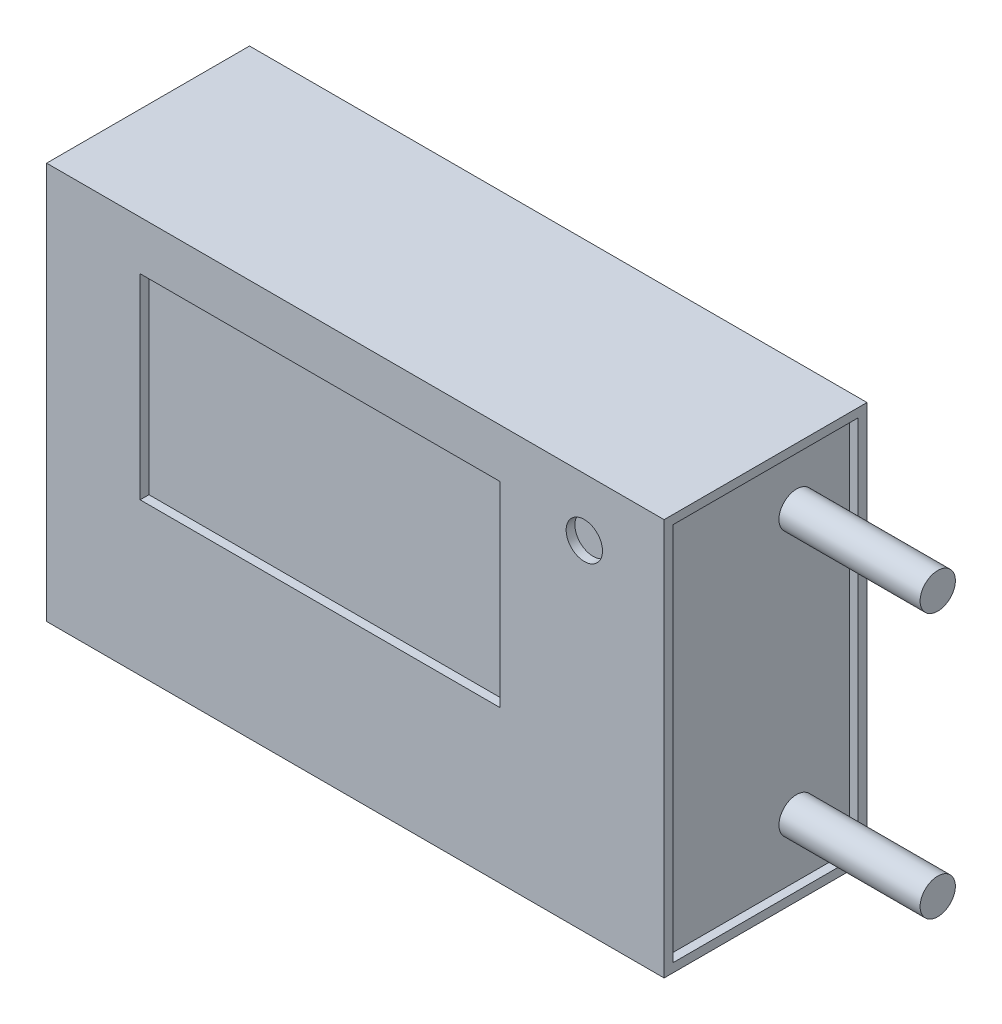
ISO-10303-21;
HEADER;
FILE_DESCRIPTION(('STEP AP214'),'2;1');
FILE_NAME('part.step','',(''),(''),'','','');
FILE_SCHEMA(('AUTOMOTIVE_DESIGN { 1 0 10303 214 1 1 1 1 }'));
ENDSEC;
DATA;
#1=APPLICATION_CONTEXT('core data for automotive mechanical design processes');
#2=APPLICATION_PROTOCOL_DEFINITION('international standard','automotive_design',2000,#1);
#3=PRODUCT_CONTEXT('',#1,'mechanical');
#4=PRODUCT('Part','Part','',(#3));
#5=PRODUCT_RELATED_PRODUCT_CATEGORY('part','',(#4));
#6=PRODUCT_DEFINITION_FORMATION('','',#4);
#7=PRODUCT_DEFINITION_CONTEXT('part definition',#1,'design');
#8=PRODUCT_DEFINITION('design','',#6,#7);
#9=PRODUCT_DEFINITION_SHAPE('','',#8);
#10=(LENGTH_UNIT() NAMED_UNIT(*) SI_UNIT(.MILLI.,.METRE.));
#11=(NAMED_UNIT(*) PLANE_ANGLE_UNIT() SI_UNIT($,.RADIAN.));
#12=(NAMED_UNIT(*) SI_UNIT($,.STERADIAN.) SOLID_ANGLE_UNIT());
#13=UNCERTAINTY_MEASURE_WITH_UNIT(LENGTH_MEASURE(1.E-05),#10,'distance_accuracy_value','');
#14=(GEOMETRIC_REPRESENTATION_CONTEXT(3) GLOBAL_UNCERTAINTY_ASSIGNED_CONTEXT((#13)) GLOBAL_UNIT_ASSIGNED_CONTEXT((#10,
#11,#12)) REPRESENTATION_CONTEXT('',''));
#15=CARTESIAN_POINT('',(0.,0.,0.));
#16=DIRECTION('',(0.,0.,1.));
#17=DIRECTION('',(1.,0.,0.));
#18=AXIS2_PLACEMENT_3D('',#15,#16,#17);
#19=CARTESIAN_POINT('',(-21.,-11.25,5.75));
#20=DIRECTION('',(0.,1.,0.));
#21=DIRECTION('',(-1.,0.,0.));
#22=AXIS2_PLACEMENT_3D('',#19,#20,#21);
#23=PLANE('',#22);
#24=DIRECTION('',(0.,0.,-1.));
#25=VECTOR('',#24,1.);
#26=CARTESIAN_POINT('',(-17.5,-11.25,-5.75));
#27=LINE('',#26,#25);
#28=CARTESIAN_POINT('',(-17.5,-11.25,5.75));
#29=VERTEX_POINT('',#28);
#30=CARTESIAN_POINT('',(-17.5,-11.25,-5.75));
#31=VERTEX_POINT('',#30);
#32=EDGE_CURVE('E152',#29,#31,#27,.T.);
#33=ORIENTED_EDGE('',*,*,#32,.T.);
#34=DIRECTION('',(1.,0.,0.));
#35=VECTOR('',#34,1.);
#36=CARTESIAN_POINT('',(-21.,-11.25,-5.75));
#37=LINE('',#36,#35);
#38=CARTESIAN_POINT('',(17.5,-11.25,-5.75));
#39=VERTEX_POINT('',#38);
#40=EDGE_CURVE('E164',#31,#39,#37,.T.);
#41=ORIENTED_EDGE('',*,*,#40,.T.);
#42=DIRECTION('',(0.,0.,1.));
#43=VECTOR('',#42,1.);
#44=CARTESIAN_POINT('',(17.5,-11.25,5.75));
#45=LINE('',#44,#43);
#46=CARTESIAN_POINT('',(17.5,-11.25,5.75));
#47=VERTEX_POINT('',#46);
#48=EDGE_CURVE('E282',#39,#47,#45,.T.);
#49=ORIENTED_EDGE('',*,*,#48,.T.);
#50=DIRECTION('',(1.,0.,0.));
#51=VECTOR('',#50,1.);
#52=CARTESIAN_POINT('',(-21.,-11.25,5.75));
#53=LINE('',#52,#51);
#54=EDGE_CURVE('E46',#29,#47,#53,.T.);
#55=ORIENTED_EDGE('',*,*,#54,.F.);
#56=EDGE_LOOP('',(#33,#41,#49,#55));
#57=FACE_BOUND('',#56,.T.);
#58=ADVANCED_FACE('F38',(#57),#23,.F.);
#59=CARTESIAN_POINT('',(-21.,11.25,5.75));
#60=DIRECTION('',(0.,-1.,0.));
#61=DIRECTION('',(0.,0.,-1.));
#62=AXIS2_PLACEMENT_3D('',#59,#60,#61);
#63=PLANE('',#62);
#64=DIRECTION('',(0.,0.,1.));
#65=VECTOR('',#64,1.);
#66=CARTESIAN_POINT('',(-17.5,11.25,5.75));
#67=LINE('',#66,#65);
#68=CARTESIAN_POINT('',(-17.5,11.25,-5.75));
#69=VERTEX_POINT('',#68);
#70=CARTESIAN_POINT('',(-17.5,11.25,5.75));
#71=VERTEX_POINT('',#70);
#72=EDGE_CURVE('E54',#69,#71,#67,.T.);
#73=ORIENTED_EDGE('',*,*,#72,.T.);
#74=DIRECTION('',(-1.,0.,0.));
#75=VECTOR('',#74,1.);
#76=CARTESIAN_POINT('',(-21.,11.25,5.75));
#77=LINE('',#76,#75);
#78=CARTESIAN_POINT('',(17.5,11.25,5.75));
#79=VERTEX_POINT('',#78);
#80=EDGE_CURVE('E13',#79,#71,#77,.T.);
#81=ORIENTED_EDGE('',*,*,#80,.F.);
#82=DIRECTION('',(0.,0.,-1.));
#83=VECTOR('',#82,1.);
#84=CARTESIAN_POINT('',(17.5,11.25,-5.75));
#85=LINE('',#84,#83);
#86=CARTESIAN_POINT('',(17.5,11.25,-5.75));
#87=VERTEX_POINT('',#86);
#88=EDGE_CURVE('E281',#79,#87,#85,.T.);
#89=ORIENTED_EDGE('',*,*,#88,.T.);
#90=DIRECTION('',(-1.,0.,0.));
#91=VECTOR('',#90,1.);
#92=CARTESIAN_POINT('',(-21.,11.25,-5.75));
#93=LINE('',#92,#91);
#94=EDGE_CURVE('E41',#87,#69,#93,.T.);
#95=ORIENTED_EDGE('',*,*,#94,.T.);
#96=EDGE_LOOP('',(#73,#81,#89,#95));
#97=FACE_BOUND('',#96,.T.);
#98=ADVANCED_FACE('F334',(#97),#63,.F.);
#99=CARTESIAN_POINT('',(0.,0.,5.75));
#100=DIRECTION('',(0.,0.,1.));
#101=DIRECTION('',(1.,0.,0.));
#102=AXIS2_PLACEMENT_3D('',#99,#100,#101);
#103=PLANE('',#102);
#104=CARTESIAN_POINT('',(12.9768258929071,7.96460152202627,5.75));
#105=DIRECTION('',(0.,0.,1.));
#106=DIRECTION('',(1.,0.,0.));
#107=AXIS2_PLACEMENT_3D('',#104,#105,#106);
#108=CIRCLE('',#107,1.03063365108844);
#109=CARTESIAN_POINT('',(14.0074595439955,7.96460152202627,5.75));
#110=VERTEX_POINT('',#109);
#111=EDGE_CURVE('E275',#110,#110,#108,.T.);
#112=ORIENTED_EDGE('',*,*,#111,.F.);
#113=EDGE_LOOP('',(#112));
#114=FACE_BOUND('',#113,.T.);
#115=DIRECTION('',(0.,-1.,0.));
#116=VECTOR('',#115,1.);
#117=CARTESIAN_POINT('',(-12.1998328200859,8.47255082345512,5.75));
#118=LINE('',#117,#116);
#119=CARTESIAN_POINT('',(-12.1998328200859,8.47255082345512,5.75));
#120=VERTEX_POINT('',#119);
#121=CARTESIAN_POINT('',(-12.1998328200859,-2.62631762446119,5.75));
#122=VERTEX_POINT('',#121);
#123=EDGE_CURVE('E262',#120,#122,#118,.T.);
#124=ORIENTED_EDGE('',*,*,#123,.F.);
#125=DIRECTION('',(-1.,0.,0.));
#126=VECTOR('',#125,1.);
#127=CARTESIAN_POINT('',(-12.1998328200859,8.47255082345512,5.75));
#128=LINE('',#127,#126);
#129=CARTESIAN_POINT('',(8.19220169162848,8.47255082345512,5.75));
#130=VERTEX_POINT('',#129);
#131=EDGE_CURVE('E252',#130,#120,#128,.T.);
#132=ORIENTED_EDGE('',*,*,#131,.F.);
#133=DIRECTION('',(0.,1.,0.));
#134=VECTOR('',#133,1.);
#135=CARTESIAN_POINT('',(8.19220169162848,8.47255082345512,5.75));
#136=LINE('',#135,#134);
#137=CARTESIAN_POINT('',(8.19220169162849,-2.62631762446119,5.75));
#138=VERTEX_POINT('',#137);
#139=EDGE_CURVE('E256',#138,#130,#136,.T.);
#140=ORIENTED_EDGE('',*,*,#139,.F.);
#141=DIRECTION('',(1.,0.,0.));
#142=VECTOR('',#141,1.);
#143=CARTESIAN_POINT('',(-12.1998328200859,-2.62631762446119,5.75));
#144=LINE('',#143,#142);
#145=EDGE_CURVE('E259',#122,#138,#144,.T.);
#146=ORIENTED_EDGE('',*,*,#145,.F.);
#147=EDGE_LOOP('',(#124,#132,#140,#146));
#148=FACE_BOUND('',#147,.T.);
#149=ORIENTED_EDGE('',*,*,#80,.T.);
#150=DIRECTION('',(0.,-1.,0.));
#151=VECTOR('',#150,1.);
#152=CARTESIAN_POINT('',(-17.5,-11.25,5.75));
#153=LINE('',#152,#151);
#154=EDGE_CURVE('E166',#71,#29,#153,.T.);
#155=ORIENTED_EDGE('',*,*,#154,.T.);
#156=ORIENTED_EDGE('',*,*,#54,.T.);
#157=DIRECTION('',(0.,1.,0.));
#158=VECTOR('',#157,1.);
#159=CARTESIAN_POINT('',(17.5,11.25,5.75));
#160=LINE('',#159,#158);
#161=EDGE_CURVE('E285',#47,#79,#160,.T.);
#162=ORIENTED_EDGE('',*,*,#161,.T.);
#163=EDGE_LOOP('',(#149,#155,#156,#162));
#164=FACE_BOUND('',#163,.T.);
#165=ADVANCED_FACE('F338',(#114,#148,#164),#103,.T.);
#166=CARTESIAN_POINT('',(0.,0.,-5.75));
#167=DIRECTION('',(0.,0.,1.));
#168=DIRECTION('',(1.,0.,0.));
#169=AXIS2_PLACEMENT_3D('',#166,#167,#168);
#170=PLANE('',#169);
#171=DIRECTION('',(0.,1.,0.));
#172=VECTOR('',#171,1.);
#173=CARTESIAN_POINT('',(-17.5,11.25,-5.75));
#174=LINE('',#173,#172);
#175=EDGE_CURVE('E149',#31,#69,#174,.T.);
#176=ORIENTED_EDGE('',*,*,#175,.T.);
#177=ORIENTED_EDGE('',*,*,#94,.F.);
#178=DIRECTION('',(0.,-1.,0.));
#179=VECTOR('',#178,1.);
#180=CARTESIAN_POINT('',(17.5,-11.25,-5.75));
#181=LINE('',#180,#179);
#182=EDGE_CURVE('E170',#87,#39,#181,.T.);
#183=ORIENTED_EDGE('',*,*,#182,.T.);
#184=ORIENTED_EDGE('',*,*,#40,.F.);
#185=EDGE_LOOP('',(#176,#177,#183,#184));
#186=FACE_BOUND('',#185,.T.);
#187=ADVANCED_FACE('F169',(#186),#170,.F.);
#188=CARTESIAN_POINT('',(-12.1998328200859,8.47255082345512,5.25));
#189=DIRECTION('',(-1.,0.,0.));
#190=DIRECTION('',(0.,0.,1.));
#191=AXIS2_PLACEMENT_3D('',#188,#189,#190);
#192=PLANE('',#191);
#193=ORIENTED_EDGE('',*,*,#123,.T.);
#194=DIRECTION('',(0.,0.,1.));
#195=VECTOR('',#194,1.);
#196=CARTESIAN_POINT('',(-12.1998328200859,-2.62631762446119,5.25));
#197=LINE('',#196,#195);
#198=CARTESIAN_POINT('',(-12.1998328200859,-2.62631762446119,5.25));
#199=VERTEX_POINT('',#198);
#200=EDGE_CURVE('E243',#199,#122,#197,.T.);
#201=ORIENTED_EDGE('',*,*,#200,.F.);
#202=DIRECTION('',(0.,-1.,0.));
#203=VECTOR('',#202,1.);
#204=CARTESIAN_POINT('',(-12.1998328200859,8.47255082345512,5.25));
#205=LINE('',#204,#203);
#206=CARTESIAN_POINT('',(-12.1998328200859,8.47255082345512,5.25));
#207=VERTEX_POINT('',#206);
#208=EDGE_CURVE('E255',#207,#199,#205,.T.);
#209=ORIENTED_EDGE('',*,*,#208,.F.);
#210=DIRECTION('',(0.,0.,1.));
#211=VECTOR('',#210,1.);
#212=CARTESIAN_POINT('',(-12.1998328200859,8.47255082345512,5.25));
#213=LINE('',#212,#211);
#214=EDGE_CURVE('E240',#207,#120,#213,.T.);
#215=ORIENTED_EDGE('',*,*,#214,.T.);
#216=EDGE_LOOP('',(#193,#201,#209,#215));
#217=FACE_BOUND('',#216,.T.);
#218=ADVANCED_FACE('F347',(#217),#192,.F.);
#219=CARTESIAN_POINT('',(-12.1998328200859,8.47255082345512,5.25));
#220=DIRECTION('',(0.,1.,0.));
#221=DIRECTION('',(0.,0.,1.));
#222=AXIS2_PLACEMENT_3D('',#219,#220,#221);
#223=PLANE('',#222);
#224=ORIENTED_EDGE('',*,*,#131,.T.);
#225=ORIENTED_EDGE('',*,*,#214,.F.);
#226=DIRECTION('',(-1.,0.,0.));
#227=VECTOR('',#226,1.);
#228=CARTESIAN_POINT('',(-12.1998328200859,8.47255082345512,5.25));
#229=LINE('',#228,#227);
#230=CARTESIAN_POINT('',(8.19220169162848,8.47255082345512,5.25));
#231=VERTEX_POINT('',#230);
#232=EDGE_CURVE('E247',#231,#207,#229,.T.);
#233=ORIENTED_EDGE('',*,*,#232,.F.);
#234=DIRECTION('',(0.,0.,1.));
#235=VECTOR('',#234,1.);
#236=CARTESIAN_POINT('',(8.19220169162848,8.47255082345512,5.25));
#237=LINE('',#236,#235);
#238=EDGE_CURVE('E249',#231,#130,#237,.T.);
#239=ORIENTED_EDGE('',*,*,#238,.T.);
#240=EDGE_LOOP('',(#224,#225,#233,#239));
#241=FACE_BOUND('',#240,.T.);
#242=ADVANCED_FACE('F410',(#241),#223,.F.);
#243=CARTESIAN_POINT('',(8.19220169162848,8.47255082345512,5.25));
#244=DIRECTION('',(1.,0.,0.));
#245=DIRECTION('',(0.,1.,0.));
#246=AXIS2_PLACEMENT_3D('',#243,#244,#245);
#247=PLANE('',#246);
#248=ORIENTED_EDGE('',*,*,#139,.T.);
#249=ORIENTED_EDGE('',*,*,#238,.F.);
#250=DIRECTION('',(0.,1.,0.));
#251=VECTOR('',#250,1.);
#252=CARTESIAN_POINT('',(8.19220169162848,8.47255082345512,5.25));
#253=LINE('',#252,#251);
#254=CARTESIAN_POINT('',(8.19220169162849,-2.62631762446119,5.25));
#255=VERTEX_POINT('',#254);
#256=EDGE_CURVE('E267',#255,#231,#253,.T.);
#257=ORIENTED_EDGE('',*,*,#256,.F.);
#258=DIRECTION('',(0.,0.,1.));
#259=VECTOR('',#258,1.);
#260=CARTESIAN_POINT('',(8.19220169162849,-2.62631762446119,5.25));
#261=LINE('',#260,#259);
#262=EDGE_CURVE('E246',#255,#138,#261,.T.);
#263=ORIENTED_EDGE('',*,*,#262,.T.);
#264=EDGE_LOOP('',(#248,#249,#257,#263));
#265=FACE_BOUND('',#264,.T.);
#266=ADVANCED_FACE('F416',(#265),#247,.F.);
#267=CARTESIAN_POINT('',(-12.1998328200859,-2.62631762446119,5.25));
#268=DIRECTION('',(0.,-1.,0.));
#269=DIRECTION('',(0.,0.,-1.));
#270=AXIS2_PLACEMENT_3D('',#267,#268,#269);
#271=PLANE('',#270);
#272=ORIENTED_EDGE('',*,*,#145,.T.);
#273=ORIENTED_EDGE('',*,*,#262,.F.);
#274=DIRECTION('',(1.,0.,0.));
#275=VECTOR('',#274,1.);
#276=CARTESIAN_POINT('',(-12.1998328200859,-2.62631762446119,5.25));
#277=LINE('',#276,#275);
#278=EDGE_CURVE('E270',#199,#255,#277,.T.);
#279=ORIENTED_EDGE('',*,*,#278,.F.);
#280=ORIENTED_EDGE('',*,*,#200,.T.);
#281=EDGE_LOOP('',(#272,#273,#279,#280));
#282=FACE_BOUND('',#281,.T.);
#283=ADVANCED_FACE('F412',(#282),#271,.F.);
#284=CARTESIAN_POINT('',(0.,0.,5.25));
#285=DIRECTION('',(0.,0.,1.));
#286=DIRECTION('',(1.,0.,0.));
#287=AXIS2_PLACEMENT_3D('',#284,#285,#286);
#288=PLANE('',#287);
#289=ORIENTED_EDGE('',*,*,#208,.T.);
#290=ORIENTED_EDGE('',*,*,#278,.T.);
#291=ORIENTED_EDGE('',*,*,#256,.T.);
#292=ORIENTED_EDGE('',*,*,#232,.T.);
#293=EDGE_LOOP('',(#289,#290,#291,#292));
#294=FACE_BOUND('',#293,.T.);
#295=ADVANCED_FACE('F415',(#294),#288,.T.);
#296=CARTESIAN_POINT('',(12.9768258929071,7.96460152202627,5.25));
#297=DIRECTION('',(0.,0.,1.));
#298=DIRECTION('',(1.,0.,0.));
#299=AXIS2_PLACEMENT_3D('',#296,#297,#298);
#300=CYLINDRICAL_SURFACE('',#299,1.03063365108844);
#301=CARTESIAN_POINT('',(12.9768258929071,7.96460152202627,5.25));
#302=DIRECTION('',(0.,0.,1.));
#303=DIRECTION('',(1.,0.,0.));
#304=AXIS2_PLACEMENT_3D('',#301,#302,#303);
#305=CIRCLE('',#304,1.03063365108844);
#306=CARTESIAN_POINT('',(14.0074595439955,7.96460152202627,5.25));
#307=VERTEX_POINT('',#306);
#308=EDGE_CURVE('E264',#307,#307,#305,.T.);
#309=ORIENTED_EDGE('',*,*,#308,.F.);
#310=EDGE_LOOP('',(#309));
#311=FACE_BOUND('',#310,.T.);
#312=ORIENTED_EDGE('',*,*,#111,.T.);
#313=EDGE_LOOP('',(#312));
#314=FACE_BOUND('',#313,.T.);
#315=ADVANCED_FACE('F426',(#311,#314),#300,.F.);
#316=CARTESIAN_POINT('',(12.9768258929071,7.96460152202627,5.25));
#317=DIRECTION('',(0.,0.,1.));
#318=DIRECTION('',(1.,0.,0.));
#319=AXIS2_PLACEMENT_3D('',#316,#317,#318);
#320=PLANE('',#319);
#321=ORIENTED_EDGE('',*,*,#308,.T.);
#322=EDGE_LOOP('',(#321));
#323=FACE_BOUND('',#322,.T.);
#324=ADVANCED_FACE('F430',(#323),#320,.T.);
#325=CARTESIAN_POINT('',(17.5,0.,0.));
#326=DIRECTION('',(1.,0.,0.));
#327=DIRECTION('',(0.,0.,-1.));
#328=AXIS2_PLACEMENT_3D('',#325,#326,#327);
#329=PLANE('',#328);
#330=ORIENTED_EDGE('',*,*,#48,.F.);
#331=ORIENTED_EDGE('',*,*,#182,.F.);
#332=ORIENTED_EDGE('',*,*,#88,.F.);
#333=ORIENTED_EDGE('',*,*,#161,.F.);
#334=EDGE_LOOP('',(#330,#331,#332,#333));
#335=FACE_BOUND('',#334,.T.);
#336=DIRECTION('',(0.,1.,0.));
#337=VECTOR('',#336,1.);
#338=CARTESIAN_POINT('',(17.5,10.75,5.25));
#339=LINE('',#338,#337);
#340=CARTESIAN_POINT('',(17.5,-10.75,5.25));
#341=VERTEX_POINT('',#340);
#342=CARTESIAN_POINT('',(17.5,10.75,5.25));
#343=VERTEX_POINT('',#342);
#344=EDGE_CURVE('E158',#341,#343,#339,.T.);
#345=ORIENTED_EDGE('',*,*,#344,.T.);
#346=DIRECTION('',(0.,0.,-1.));
#347=VECTOR('',#346,1.);
#348=CARTESIAN_POINT('',(17.5,10.75,-5.25));
#349=LINE('',#348,#347);
#350=CARTESIAN_POINT('',(17.5,10.75,-5.25));
#351=VERTEX_POINT('',#350);
#352=EDGE_CURVE('E284',#343,#351,#349,.T.);
#353=ORIENTED_EDGE('',*,*,#352,.T.);
#354=DIRECTION('',(0.,-1.,0.));
#355=VECTOR('',#354,1.);
#356=CARTESIAN_POINT('',(17.5,-10.75,-5.25));
#357=LINE('',#356,#355);
#358=CARTESIAN_POINT('',(17.5,-10.75,-5.25));
#359=VERTEX_POINT('',#358);
#360=EDGE_CURVE('E293',#351,#359,#357,.T.);
#361=ORIENTED_EDGE('',*,*,#360,.T.);
#362=DIRECTION('',(0.,0.,1.));
#363=VECTOR('',#362,1.);
#364=CARTESIAN_POINT('',(17.5,-10.75,5.25));
#365=LINE('',#364,#363);
#366=EDGE_CURVE('E291',#359,#341,#365,.T.);
#367=ORIENTED_EDGE('',*,*,#366,.T.);
#368=EDGE_LOOP('',(#345,#353,#361,#367));
#369=FACE_BOUND('',#368,.T.);
#370=ADVANCED_FACE('F385',(#335,#369),#329,.T.);
#371=CARTESIAN_POINT('',(25.,7.5,-2.2599444652056));
#372=DIRECTION('',(1.,0.,0.));
#373=DIRECTION('',(0.,0.,-1.));
#374=AXIS2_PLACEMENT_3D('',#371,#372,#373);
#375=PLANE('',#374);
#376=CARTESIAN_POINT('',(25.,7.5,-2.2599444652056));
#377=DIRECTION('',(1.,0.,0.));
#378=DIRECTION('',(0.,0.,-1.));
#379=AXIS2_PLACEMENT_3D('',#376,#377,#378);
#380=CIRCLE('',#379,1.);
#381=CARTESIAN_POINT('',(25.,7.5,-3.2599444652056));
#382=VERTEX_POINT('',#381);
#383=EDGE_CURVE('E218',#382,#382,#380,.T.);
#384=ORIENTED_EDGE('',*,*,#383,.T.);
#385=EDGE_LOOP('',(#384));
#386=FACE_BOUND('',#385,.T.);
#387=ADVANCED_FACE('F382',(#386),#375,.T.);
#388=CARTESIAN_POINT('',(25.,-7.5,-2.2599444652056));
#389=DIRECTION('',(-1.,0.,0.));
#390=DIRECTION('',(0.,0.,1.));
#391=AXIS2_PLACEMENT_3D('',#388,#389,#390);
#392=PLANE('',#391);
#393=CARTESIAN_POINT('',(25.,-7.5,-2.2599444652056));
#394=DIRECTION('',(1.,0.,0.));
#395=DIRECTION('',(0.,0.,1.));
#396=AXIS2_PLACEMENT_3D('',#393,#394,#395);
#397=CIRCLE('',#396,1.);
#398=CARTESIAN_POINT('',(25.,-7.5,-1.2599444652056));
#399=VERTEX_POINT('',#398);
#400=EDGE_CURVE('E222',#399,#399,#397,.T.);
#401=ORIENTED_EDGE('',*,*,#400,.T.);
#402=EDGE_LOOP('',(#401));
#403=FACE_BOUND('',#402,.T.);
#404=ADVANCED_FACE('F380',(#403),#392,.F.);
#405=CARTESIAN_POINT('',(25.,7.5,-2.2599444652056));
#406=DIRECTION('',(-1.,0.,0.));
#407=DIRECTION('',(0.,0.,1.));
#408=AXIS2_PLACEMENT_3D('',#405,#406,#407);
#409=CYLINDRICAL_SURFACE('',#408,1.);
#410=ORIENTED_EDGE('',*,*,#383,.F.);
#411=EDGE_LOOP('',(#410));
#412=FACE_BOUND('',#411,.T.);
#413=CARTESIAN_POINT('',(17.,7.5,-2.2599444652056));
#414=DIRECTION('',(1.,0.,0.));
#415=DIRECTION('',(0.,0.,-1.));
#416=AXIS2_PLACEMENT_3D('',#413,#414,#415);
#417=CIRCLE('',#416,1.);
#418=CARTESIAN_POINT('',(17.,7.5,-3.2599444652056));
#419=VERTEX_POINT('',#418);
#420=EDGE_CURVE('E219',#419,#419,#417,.T.);
#421=ORIENTED_EDGE('',*,*,#420,.T.);
#422=EDGE_LOOP('',(#421));
#423=FACE_BOUND('',#422,.T.);
#424=ADVANCED_FACE('F377',(#412,#423),#409,.T.);
#425=CARTESIAN_POINT('',(25.,-7.5,-2.2599444652056));
#426=DIRECTION('',(-1.,0.,0.));
#427=DIRECTION('',(0.,0.,1.));
#428=AXIS2_PLACEMENT_3D('',#425,#426,#427);
#429=CYLINDRICAL_SURFACE('',#428,1.);
#430=ORIENTED_EDGE('',*,*,#400,.F.);
#431=EDGE_LOOP('',(#430));
#432=FACE_BOUND('',#431,.T.);
#433=CARTESIAN_POINT('',(17.,-7.5,-2.2599444652056));
#434=DIRECTION('',(1.,0.,0.));
#435=DIRECTION('',(0.,0.,1.));
#436=AXIS2_PLACEMENT_3D('',#433,#434,#435);
#437=CIRCLE('',#436,1.);
#438=CARTESIAN_POINT('',(17.,-7.5,-1.2599444652056));
#439=VERTEX_POINT('',#438);
#440=EDGE_CURVE('E225',#439,#439,#437,.T.);
#441=ORIENTED_EDGE('',*,*,#440,.T.);
#442=EDGE_LOOP('',(#441));
#443=FACE_BOUND('',#442,.T.);
#444=ADVANCED_FACE('F367',(#432,#443),#429,.T.);
#445=CARTESIAN_POINT('',(17.,0.,0.));
#446=DIRECTION('',(1.,0.,0.));
#447=DIRECTION('',(0.,0.,-1.));
#448=AXIS2_PLACEMENT_3D('',#445,#446,#447);
#449=PLANE('',#448);
#450=ORIENTED_EDGE('',*,*,#440,.F.);
#451=EDGE_LOOP('',(#450));
#452=FACE_BOUND('',#451,.T.);
#453=ORIENTED_EDGE('',*,*,#420,.F.);
#454=EDGE_LOOP('',(#453));
#455=FACE_BOUND('',#454,.T.);
#456=DIRECTION('',(0.,0.,-1.));
#457=VECTOR('',#456,1.);
#458=CARTESIAN_POINT('',(17.,-10.75,5.25));
#459=LINE('',#458,#457);
#460=CARTESIAN_POINT('',(17.,-10.75,5.25));
#461=VERTEX_POINT('',#460);
#462=CARTESIAN_POINT('',(17.,-10.75,-5.25));
#463=VERTEX_POINT('',#462);
#464=EDGE_CURVE('E194',#461,#463,#459,.T.);
#465=ORIENTED_EDGE('',*,*,#464,.T.);
#466=DIRECTION('',(0.,1.,0.));
#467=VECTOR('',#466,1.);
#468=CARTESIAN_POINT('',(17.,-10.75,-5.25));
#469=LINE('',#468,#467);
#470=CARTESIAN_POINT('',(17.,10.75,-5.25));
#471=VERTEX_POINT('',#470);
#472=EDGE_CURVE('E191',#463,#471,#469,.T.);
#473=ORIENTED_EDGE('',*,*,#472,.T.);
#474=DIRECTION('',(0.,0.,1.));
#475=VECTOR('',#474,1.);
#476=CARTESIAN_POINT('',(17.,10.75,-5.25));
#477=LINE('',#476,#475);
#478=CARTESIAN_POINT('',(17.,10.75,5.25));
#479=VERTEX_POINT('',#478);
#480=EDGE_CURVE('E188',#471,#479,#477,.T.);
#481=ORIENTED_EDGE('',*,*,#480,.T.);
#482=DIRECTION('',(0.,-1.,0.));
#483=VECTOR('',#482,1.);
#484=CARTESIAN_POINT('',(17.,10.75,5.25));
#485=LINE('',#484,#483);
#486=EDGE_CURVE('E181',#479,#461,#485,.T.);
#487=ORIENTED_EDGE('',*,*,#486,.T.);
#488=EDGE_LOOP('',(#465,#473,#481,#487));
#489=FACE_BOUND('',#488,.T.);
#490=ADVANCED_FACE('F358',(#452,#455,#489),#449,.T.);
#491=CARTESIAN_POINT('',(17.,-10.75,-5.25));
#492=DIRECTION('',(0.,0.,-1.));
#493=DIRECTION('',(-1.,0.,0.));
#494=AXIS2_PLACEMENT_3D('',#491,#492,#493);
#495=PLANE('',#494);
#496=ORIENTED_EDGE('',*,*,#360,.F.);
#497=DIRECTION('',(1.,0.,0.));
#498=VECTOR('',#497,1.);
#499=CARTESIAN_POINT('',(17.,10.75,-5.25));
#500=LINE('',#499,#498);
#501=EDGE_CURVE('E180',#471,#351,#500,.T.);
#502=ORIENTED_EDGE('',*,*,#501,.F.);
#503=ORIENTED_EDGE('',*,*,#472,.F.);
#504=DIRECTION('',(1.,0.,0.));
#505=VECTOR('',#504,1.);
#506=CARTESIAN_POINT('',(17.,-10.75,-5.25));
#507=LINE('',#506,#505);
#508=EDGE_CURVE('E177',#463,#359,#507,.T.);
#509=ORIENTED_EDGE('',*,*,#508,.T.);
#510=EDGE_LOOP('',(#496,#502,#503,#509));
#511=FACE_BOUND('',#510,.T.);
#512=ADVANCED_FACE('F354',(#511),#495,.F.);
#513=CARTESIAN_POINT('',(17.,10.75,-5.25));
#514=DIRECTION('',(0.,1.,0.));
#515=DIRECTION('',(0.,0.,1.));
#516=AXIS2_PLACEMENT_3D('',#513,#514,#515);
#517=PLANE('',#516);
#518=ORIENTED_EDGE('',*,*,#352,.F.);
#519=DIRECTION('',(1.,0.,0.));
#520=VECTOR('',#519,1.);
#521=CARTESIAN_POINT('',(17.,10.75,5.25));
#522=LINE('',#521,#520);
#523=EDGE_CURVE('E173',#479,#343,#522,.T.);
#524=ORIENTED_EDGE('',*,*,#523,.F.);
#525=ORIENTED_EDGE('',*,*,#480,.F.);
#526=ORIENTED_EDGE('',*,*,#501,.T.);
#527=EDGE_LOOP('',(#518,#524,#525,#526));
#528=FACE_BOUND('',#527,.T.);
#529=ADVANCED_FACE('F357',(#528),#517,.F.);
#530=CARTESIAN_POINT('',(17.,10.75,5.25));
#531=DIRECTION('',(0.,0.,1.));
#532=DIRECTION('',(1.,0.,0.));
#533=AXIS2_PLACEMENT_3D('',#530,#531,#532);
#534=PLANE('',#533);
#535=ORIENTED_EDGE('',*,*,#344,.F.);
#536=DIRECTION('',(1.,0.,0.));
#537=VECTOR('',#536,1.);
#538=CARTESIAN_POINT('',(17.,-10.75,5.25));
#539=LINE('',#538,#537);
#540=EDGE_CURVE('E171',#461,#341,#539,.T.);
#541=ORIENTED_EDGE('',*,*,#540,.F.);
#542=ORIENTED_EDGE('',*,*,#486,.F.);
#543=ORIENTED_EDGE('',*,*,#523,.T.);
#544=EDGE_LOOP('',(#535,#541,#542,#543));
#545=FACE_BOUND('',#544,.T.);
#546=ADVANCED_FACE('F352',(#545),#534,.F.);
#547=CARTESIAN_POINT('',(17.,-10.75,5.25));
#548=DIRECTION('',(0.,-1.,0.));
#549=DIRECTION('',(0.,0.,-1.));
#550=AXIS2_PLACEMENT_3D('',#547,#548,#549);
#551=PLANE('',#550);
#552=ORIENTED_EDGE('',*,*,#366,.F.);
#553=ORIENTED_EDGE('',*,*,#508,.F.);
#554=ORIENTED_EDGE('',*,*,#464,.F.);
#555=ORIENTED_EDGE('',*,*,#540,.T.);
#556=EDGE_LOOP('',(#552,#553,#554,#555));
#557=FACE_BOUND('',#556,.T.);
#558=ADVANCED_FACE('F349',(#557),#551,.F.);
#559=CARTESIAN_POINT('',(-17.5,0.,0.));
#560=DIRECTION('',(-1.,0.,0.));
#561=DIRECTION('',(0.,0.,-1.));
#562=AXIS2_PLACEMENT_3D('',#559,#560,#561);
#563=PLANE('',#562);
#564=ORIENTED_EDGE('',*,*,#72,.F.);
#565=ORIENTED_EDGE('',*,*,#175,.F.);
#566=ORIENTED_EDGE('',*,*,#32,.F.);
#567=ORIENTED_EDGE('',*,*,#154,.F.);
#568=EDGE_LOOP('',(#564,#565,#566,#567));
#569=FACE_BOUND('',#568,.T.);
#570=DIRECTION('',(0.,0.,1.));
#571=VECTOR('',#570,1.);
#572=CARTESIAN_POINT('',(-17.5,10.75,5.25));
#573=LINE('',#572,#571);
#574=CARTESIAN_POINT('',(-17.5,10.75,-5.25));
#575=VERTEX_POINT('',#574);
#576=CARTESIAN_POINT('',(-17.5,10.75,5.25));
#577=VERTEX_POINT('',#576);
#578=EDGE_CURVE('E62',#575,#577,#573,.T.);
#579=ORIENTED_EDGE('',*,*,#578,.T.);
#580=DIRECTION('',(0.,-1.,0.));
#581=VECTOR('',#580,1.);
#582=CARTESIAN_POINT('',(-17.5,-10.75,5.25));
#583=LINE('',#582,#581);
#584=CARTESIAN_POINT('',(-17.5,-10.75,5.25));
#585=VERTEX_POINT('',#584);
#586=EDGE_CURVE('E298',#577,#585,#583,.T.);
#587=ORIENTED_EDGE('',*,*,#586,.T.);
#588=DIRECTION('',(0.,0.,-1.));
#589=VECTOR('',#588,1.);
#590=CARTESIAN_POINT('',(-17.5,-10.75,-5.25));
#591=LINE('',#590,#589);
#592=CARTESIAN_POINT('',(-17.5,-10.75,-5.25));
#593=VERTEX_POINT('',#592);
#594=EDGE_CURVE('E301',#585,#593,#591,.T.);
#595=ORIENTED_EDGE('',*,*,#594,.T.);
#596=DIRECTION('',(0.,1.,0.));
#597=VECTOR('',#596,1.);
#598=CARTESIAN_POINT('',(-17.5,10.75,-5.25));
#599=LINE('',#598,#597);
#600=EDGE_CURVE('E159',#593,#575,#599,.T.);
#601=ORIENTED_EDGE('',*,*,#600,.T.);
#602=EDGE_LOOP('',(#579,#587,#595,#601));
#603=FACE_BOUND('',#602,.T.);
#604=ADVANCED_FACE('F151',(#569,#603),#563,.T.);
#605=CARTESIAN_POINT('',(-25.,2.9881487928831,-3.36480620375057));
#606=DIRECTION('',(-1.,0.,0.));
#607=DIRECTION('',(0.,0.,1.));
#608=AXIS2_PLACEMENT_3D('',#605,#606,#607);
#609=PLANE('',#608);
#610=CARTESIAN_POINT('',(-25.,2.9881487928831,-3.36480620375057));
#611=DIRECTION('',(-1.,0.,0.));
#612=DIRECTION('',(0.,0.,1.));
#613=AXIS2_PLACEMENT_3D('',#610,#611,#612);
#614=CIRCLE('',#613,0.5);
#615=CARTESIAN_POINT('',(-25.,2.9881487928831,-2.86480620375057));
#616=VERTEX_POINT('',#615);
#617=EDGE_CURVE('E228',#616,#616,#614,.T.);
#618=ORIENTED_EDGE('',*,*,#617,.T.);
#619=EDGE_LOOP('',(#618));
#620=FACE_BOUND('',#619,.T.);
#621=ADVANCED_FACE('F398',(#620),#609,.T.);
#622=CARTESIAN_POINT('',(-25.,-2.9881487928831,-3.36480620375057));
#623=DIRECTION('',(1.,0.,0.));
#624=DIRECTION('',(0.,0.,-1.));
#625=AXIS2_PLACEMENT_3D('',#622,#623,#624);
#626=PLANE('',#625);
#627=CARTESIAN_POINT('',(-25.,-2.9881487928831,-3.36480620375057));
#628=DIRECTION('',(-1.,0.,0.));
#629=DIRECTION('',(0.,0.,-1.));
#630=AXIS2_PLACEMENT_3D('',#627,#628,#629);
#631=CIRCLE('',#630,0.5);
#632=CARTESIAN_POINT('',(-25.,-2.9881487928831,-3.86480620375057));
#633=VERTEX_POINT('',#632);
#634=EDGE_CURVE('E234',#633,#633,#631,.T.);
#635=ORIENTED_EDGE('',*,*,#634,.T.);
#636=EDGE_LOOP('',(#635));
#637=FACE_BOUND('',#636,.T.);
#638=ADVANCED_FACE('F396',(#637),#626,.F.);
#639=CARTESIAN_POINT('',(-25.,2.9881487928831,-3.36480620375057));
#640=DIRECTION('',(1.,0.,0.));
#641=DIRECTION('',(0.,0.,-1.));
#642=AXIS2_PLACEMENT_3D('',#639,#640,#641);
#643=CYLINDRICAL_SURFACE('',#642,0.5);
#644=ORIENTED_EDGE('',*,*,#617,.F.);
#645=EDGE_LOOP('',(#644));
#646=FACE_BOUND('',#645,.T.);
#647=CARTESIAN_POINT('',(-17.,2.9881487928831,-3.36480620375057));
#648=DIRECTION('',(-1.,0.,0.));
#649=DIRECTION('',(0.,0.,1.));
#650=AXIS2_PLACEMENT_3D('',#647,#648,#649);
#651=CIRCLE('',#650,0.5);
#652=CARTESIAN_POINT('',(-17.,2.9881487928831,-2.86480620375057));
#653=VERTEX_POINT('',#652);
#654=EDGE_CURVE('E231',#653,#653,#651,.T.);
#655=ORIENTED_EDGE('',*,*,#654,.T.);
#656=EDGE_LOOP('',(#655));
#657=FACE_BOUND('',#656,.T.);
#658=ADVANCED_FACE('F393',(#646,#657),#643,.T.);
#659=CARTESIAN_POINT('',(-25.,-2.9881487928831,-3.36480620375057));
#660=DIRECTION('',(1.,0.,0.));
#661=DIRECTION('',(0.,0.,-1.));
#662=AXIS2_PLACEMENT_3D('',#659,#660,#661);
#663=CYLINDRICAL_SURFACE('',#662,0.5);
#664=ORIENTED_EDGE('',*,*,#634,.F.);
#665=EDGE_LOOP('',(#664));
#666=FACE_BOUND('',#665,.T.);
#667=CARTESIAN_POINT('',(-17.,-2.9881487928831,-3.36480620375057));
#668=DIRECTION('',(-1.,0.,0.));
#669=DIRECTION('',(0.,0.,-1.));
#670=AXIS2_PLACEMENT_3D('',#667,#668,#669);
#671=CIRCLE('',#670,0.5);
#672=CARTESIAN_POINT('',(-17.,-2.9881487928831,-3.86480620375057));
#673=VERTEX_POINT('',#672);
#674=EDGE_CURVE('E237',#673,#673,#671,.T.);
#675=ORIENTED_EDGE('',*,*,#674,.T.);
#676=EDGE_LOOP('',(#675));
#677=FACE_BOUND('',#676,.T.);
#678=ADVANCED_FACE('F329',(#666,#677),#663,.T.);
#679=CARTESIAN_POINT('',(-17.,0.,0.));
#680=DIRECTION('',(-1.,0.,0.));
#681=DIRECTION('',(0.,0.,-1.));
#682=AXIS2_PLACEMENT_3D('',#679,#680,#681);
#683=PLANE('',#682);
#684=ORIENTED_EDGE('',*,*,#674,.F.);
#685=EDGE_LOOP('',(#684));
#686=FACE_BOUND('',#685,.T.);
#687=ORIENTED_EDGE('',*,*,#654,.F.);
#688=EDGE_LOOP('',(#687));
#689=FACE_BOUND('',#688,.T.);
#690=DIRECTION('',(0.,0.,-1.));
#691=VECTOR('',#690,1.);
#692=CARTESIAN_POINT('',(-17.,-10.75,5.25));
#693=LINE('',#692,#691);
#694=CARTESIAN_POINT('',(-17.,-10.75,5.25));
#695=VERTEX_POINT('',#694);
#696=CARTESIAN_POINT('',(-17.,-10.75,-5.25));
#697=VERTEX_POINT('',#696);
#698=EDGE_CURVE('E215',#695,#697,#693,.T.);
#699=ORIENTED_EDGE('',*,*,#698,.F.);
#700=DIRECTION('',(0.,-1.,0.));
#701=VECTOR('',#700,1.);
#702=CARTESIAN_POINT('',(-17.,10.75,5.25));
#703=LINE('',#702,#701);
#704=CARTESIAN_POINT('',(-17.,10.75,5.25));
#705=VERTEX_POINT('',#704);
#706=EDGE_CURVE('E213',#705,#695,#703,.T.);
#707=ORIENTED_EDGE('',*,*,#706,.F.);
#708=DIRECTION('',(0.,0.,1.));
#709=VECTOR('',#708,1.);
#710=CARTESIAN_POINT('',(-17.,10.75,-5.25));
#711=LINE('',#710,#709);
#712=CARTESIAN_POINT('',(-17.,10.75,-5.25));
#713=VERTEX_POINT('',#712);
#714=EDGE_CURVE('E211',#713,#705,#711,.T.);
#715=ORIENTED_EDGE('',*,*,#714,.F.);
#716=DIRECTION('',(0.,1.,0.));
#717=VECTOR('',#716,1.);
#718=CARTESIAN_POINT('',(-17.,-10.75,-5.25));
#719=LINE('',#718,#717);
#720=EDGE_CURVE('E202',#697,#713,#719,.T.);
#721=ORIENTED_EDGE('',*,*,#720,.F.);
#722=EDGE_LOOP('',(#699,#707,#715,#721));
#723=FACE_BOUND('',#722,.T.);
#724=ADVANCED_FACE('F315',(#686,#689,#723),#683,.T.);
#725=CARTESIAN_POINT('',(-17.,10.75,5.25));
#726=DIRECTION('',(0.,0.,-1.));
#727=DIRECTION('',(-1.,0.,0.));
#728=AXIS2_PLACEMENT_3D('',#725,#726,#727);
#729=PLANE('',#728);
#730=DIRECTION('',(-1.,0.,0.));
#731=VECTOR('',#730,1.);
#732=CARTESIAN_POINT('',(-17.,-10.75,5.25));
#733=LINE('',#732,#731);
#734=EDGE_CURVE('E198',#695,#585,#733,.T.);
#735=ORIENTED_EDGE('',*,*,#734,.T.);
#736=ORIENTED_EDGE('',*,*,#586,.F.);
#737=DIRECTION('',(-1.,0.,0.));
#738=VECTOR('',#737,1.);
#739=CARTESIAN_POINT('',(-17.,10.75,5.25));
#740=LINE('',#739,#738);
#741=EDGE_CURVE('E201',#705,#577,#740,.T.);
#742=ORIENTED_EDGE('',*,*,#741,.F.);
#743=ORIENTED_EDGE('',*,*,#706,.T.);
#744=EDGE_LOOP('',(#735,#736,#742,#743));
#745=FACE_BOUND('',#744,.T.);
#746=ADVANCED_FACE('F321',(#745),#729,.T.);
#747=CARTESIAN_POINT('',(-17.,10.75,-5.25));
#748=DIRECTION('',(0.,-1.,0.));
#749=DIRECTION('',(0.,0.,-1.));
#750=AXIS2_PLACEMENT_3D('',#747,#748,#749);
#751=PLANE('',#750);
#752=ORIENTED_EDGE('',*,*,#741,.T.);
#753=ORIENTED_EDGE('',*,*,#578,.F.);
#754=DIRECTION('',(-1.,0.,0.));
#755=VECTOR('',#754,1.);
#756=CARTESIAN_POINT('',(-17.,10.75,-5.25));
#757=LINE('',#756,#755);
#758=EDGE_CURVE('E205',#713,#575,#757,.T.);
#759=ORIENTED_EDGE('',*,*,#758,.F.);
#760=ORIENTED_EDGE('',*,*,#714,.T.);
#761=EDGE_LOOP('',(#752,#753,#759,#760));
#762=FACE_BOUND('',#761,.T.);
#763=ADVANCED_FACE('F309',(#762),#751,.T.);
#764=CARTESIAN_POINT('',(-17.,-10.75,-5.25));
#765=DIRECTION('',(0.,0.,1.));
#766=DIRECTION('',(1.,0.,0.));
#767=AXIS2_PLACEMENT_3D('',#764,#765,#766);
#768=PLANE('',#767);
#769=ORIENTED_EDGE('',*,*,#758,.T.);
#770=ORIENTED_EDGE('',*,*,#600,.F.);
#771=DIRECTION('',(-1.,0.,0.));
#772=VECTOR('',#771,1.);
#773=CARTESIAN_POINT('',(-17.,-10.75,-5.25));
#774=LINE('',#773,#772);
#775=EDGE_CURVE('E197',#697,#593,#774,.T.);
#776=ORIENTED_EDGE('',*,*,#775,.F.);
#777=ORIENTED_EDGE('',*,*,#720,.T.);
#778=EDGE_LOOP('',(#769,#770,#776,#777));
#779=FACE_BOUND('',#778,.T.);
#780=ADVANCED_FACE('F312',(#779),#768,.T.);
#781=CARTESIAN_POINT('',(-17.,-10.75,5.25));
#782=DIRECTION('',(0.,1.,0.));
#783=DIRECTION('',(0.,0.,1.));
#784=AXIS2_PLACEMENT_3D('',#781,#782,#783);
#785=PLANE('',#784);
#786=ORIENTED_EDGE('',*,*,#775,.T.);
#787=ORIENTED_EDGE('',*,*,#594,.F.);
#788=ORIENTED_EDGE('',*,*,#734,.F.);
#789=ORIENTED_EDGE('',*,*,#698,.T.);
#790=EDGE_LOOP('',(#786,#787,#788,#789));
#791=FACE_BOUND('',#790,.T.);
#792=ADVANCED_FACE('F319',(#791),#785,.T.);
#793=CLOSED_SHELL('',(#58,#98,#165,#187,#218,#242,#266,#283,#295,#315,#324,#370,#387,#404,#424,
#444,#490,#512,#529,#546,#558,#604,#621,#638,#658,#678,#724,#746,#763,#780,#792));
#794=MANIFOLD_SOLID_BREP('B2',#793);
#795=ADVANCED_BREP_SHAPE_REPRESENTATION('',(#18,#794),#14);
#796=SHAPE_DEFINITION_REPRESENTATION(#9,#795);
ENDSEC;
END-ISO-10303-21;
